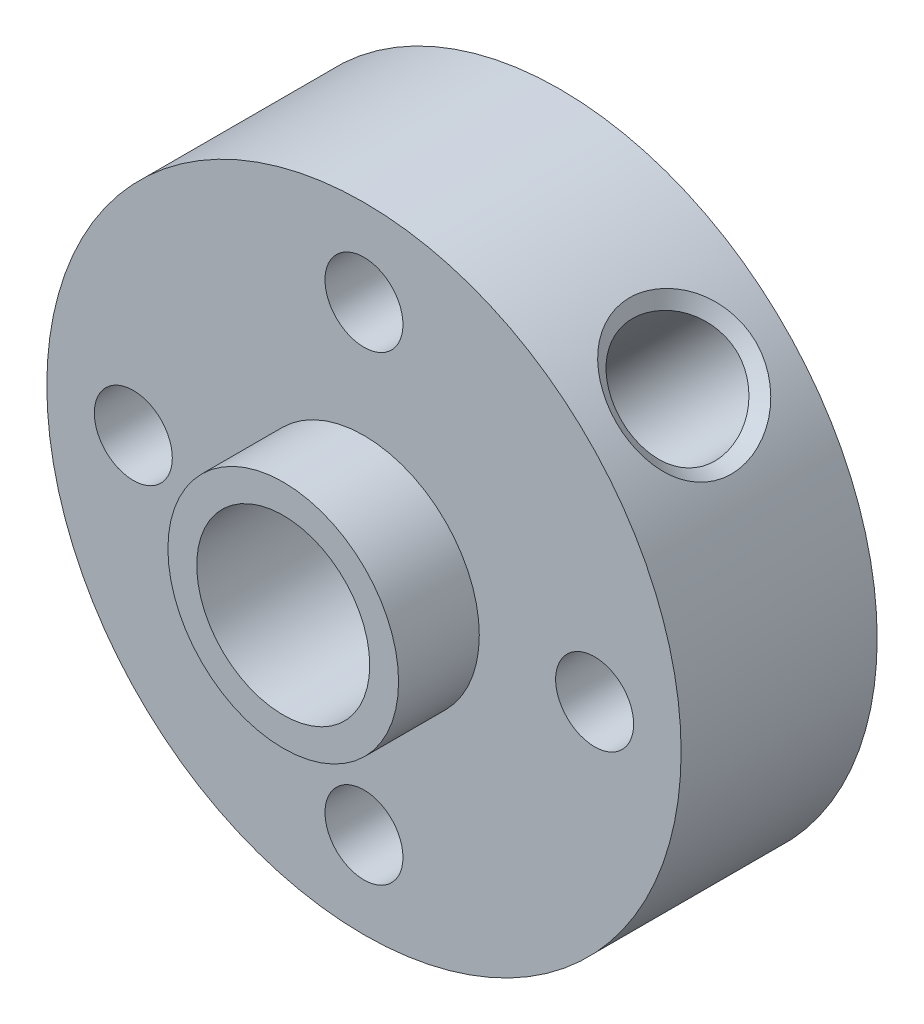
ISO-10303-21;
HEADER;
FILE_DESCRIPTION(('STEP AP214'),'2;1');
FILE_NAME('part.step','',(''),(''),'','','');
FILE_SCHEMA(('AUTOMOTIVE_DESIGN { 1 0 10303 214 1 1 1 1 }'));
ENDSEC;
DATA;
#1=APPLICATION_CONTEXT('core data for automotive mechanical design processes');
#2=APPLICATION_PROTOCOL_DEFINITION('international standard','automotive_design',2000,#1);
#3=PRODUCT_CONTEXT('',#1,'mechanical');
#4=PRODUCT('Part','Part','',(#3));
#5=PRODUCT_RELATED_PRODUCT_CATEGORY('part','',(#4));
#6=PRODUCT_DEFINITION_FORMATION('','',#4);
#7=PRODUCT_DEFINITION_CONTEXT('part definition',#1,'design');
#8=PRODUCT_DEFINITION('design','',#6,#7);
#9=PRODUCT_DEFINITION_SHAPE('','',#8);
#10=(LENGTH_UNIT() NAMED_UNIT(*) SI_UNIT(.MILLI.,.METRE.));
#11=(NAMED_UNIT(*) PLANE_ANGLE_UNIT() SI_UNIT($,.RADIAN.));
#12=(NAMED_UNIT(*) SI_UNIT($,.STERADIAN.) SOLID_ANGLE_UNIT());
#13=UNCERTAINTY_MEASURE_WITH_UNIT(LENGTH_MEASURE(1.E-05),#10,'distance_accuracy_value','');
#14=(GEOMETRIC_REPRESENTATION_CONTEXT(3) GLOBAL_UNCERTAINTY_ASSIGNED_CONTEXT((#13)) GLOBAL_UNIT_ASSIGNED_CONTEXT((#10,
#11,#12)) REPRESENTATION_CONTEXT('',''));
#15=CARTESIAN_POINT('',(0.,0.,0.));
#16=DIRECTION('',(0.,0.,1.));
#17=DIRECTION('',(1.,0.,0.));
#18=AXIS2_PLACEMENT_3D('',#15,#16,#17);
#19=CARTESIAN_POINT('',(0.,0.,3.4));
#20=DIRECTION('',(0.,0.,1.));
#21=DIRECTION('',(1.,0.,0.));
#22=AXIS2_PLACEMENT_3D('',#19,#20,#21);
#23=PLANE('',#22);
#24=CARTESIAN_POINT('',(0.,8.,3.4));
#25=DIRECTION('',(0.,0.,1.));
#26=DIRECTION('',(1.,0.,0.));
#27=AXIS2_PLACEMENT_3D('',#24,#25,#26);
#28=CIRCLE('',#27,1.35254999999999);
#29=CARTESIAN_POINT('',(1.35254999999999,8.,3.4));
#30=VERTEX_POINT('',#29);
#31=EDGE_CURVE('E182',#30,#30,#28,.T.);
#32=ORIENTED_EDGE('',*,*,#31,.F.);
#33=EDGE_LOOP('',(#32));
#34=FACE_BOUND('',#33,.T.);
#35=CARTESIAN_POINT('',(-8.,0.,3.4));
#36=DIRECTION('',(0.,0.,1.));
#37=DIRECTION('',(1.,0.,0.));
#38=AXIS2_PLACEMENT_3D('',#35,#36,#37);
#39=CIRCLE('',#38,1.35254999999999);
#40=CARTESIAN_POINT('',(-6.64745000000001,0.,3.4));
#41=VERTEX_POINT('',#40);
#42=EDGE_CURVE('E174',#41,#41,#39,.T.);
#43=ORIENTED_EDGE('',*,*,#42,.F.);
#44=EDGE_LOOP('',(#43));
#45=FACE_BOUND('',#44,.T.);
#46=CARTESIAN_POINT('',(8.,0.,3.4));
#47=DIRECTION('',(0.,0.,1.));
#48=DIRECTION('',(1.,0.,0.));
#49=AXIS2_PLACEMENT_3D('',#46,#47,#48);
#50=CIRCLE('',#49,1.35254999999999);
#51=CARTESIAN_POINT('',(9.35254999999999,0.,3.4));
#52=VERTEX_POINT('',#51);
#53=EDGE_CURVE('E169',#52,#52,#50,.T.);
#54=ORIENTED_EDGE('',*,*,#53,.F.);
#55=EDGE_LOOP('',(#54));
#56=FACE_BOUND('',#55,.T.);
#57=CARTESIAN_POINT('',(0.,-8.,3.4));
#58=DIRECTION('',(0.,0.,1.));
#59=DIRECTION('',(1.,0.,0.));
#60=AXIS2_PLACEMENT_3D('',#57,#58,#59);
#61=CIRCLE('',#60,1.35254999999999);
#62=CARTESIAN_POINT('',(1.35254999999999,-8.,3.4));
#63=VERTEX_POINT('',#62);
#64=EDGE_CURVE('E96',#63,#63,#61,.T.);
#65=ORIENTED_EDGE('',*,*,#64,.F.);
#66=EDGE_LOOP('',(#65));
#67=FACE_BOUND('',#66,.T.);
#68=CARTESIAN_POINT('',(0.,0.,3.4));
#69=DIRECTION('',(0.,0.,1.));
#70=DIRECTION('',(1.,0.,0.));
#71=AXIS2_PLACEMENT_3D('',#68,#69,#70);
#72=CIRCLE('',#71,11.);
#73=CARTESIAN_POINT('',(11.,0.,3.4));
#74=VERTEX_POINT('',#73);
#75=EDGE_CURVE('E57',#74,#74,#72,.T.);
#76=ORIENTED_EDGE('',*,*,#75,.T.);
#77=EDGE_LOOP('',(#76));
#78=FACE_BOUND('',#77,.T.);
#79=CARTESIAN_POINT('',(0.,0.,3.4));
#80=DIRECTION('',(0.,0.,1.));
#81=DIRECTION('',(1.,0.,0.));
#82=AXIS2_PLACEMENT_3D('',#79,#80,#81);
#83=CIRCLE('',#82,4.);
#84=CARTESIAN_POINT('',(4.,0.,3.4));
#85=VERTEX_POINT('',#84);
#86=EDGE_CURVE('E65',#85,#85,#83,.T.);
#87=ORIENTED_EDGE('',*,*,#86,.F.);
#88=EDGE_LOOP('',(#87));
#89=FACE_BOUND('',#88,.T.);
#90=ADVANCED_FACE('F35',(#34,#45,#56,#67,#78,#89),#23,.T.);
#91=CARTESIAN_POINT('',(0.,0.,-3.4));
#92=DIRECTION('',(0.,0.,1.));
#93=DIRECTION('',(1.,0.,0.));
#94=AXIS2_PLACEMENT_3D('',#91,#92,#93);
#95=CYLINDRICAL_SURFACE('',#94,11.);
#96=CARTESIAN_POINT('',(5.80850921114971,9.34137145948008,0.));
#97=CARTESIAN_POINT('',(5.80860175270186,9.34130684226353,0.637752239425181));
#98=CARTESIAN_POINT('',(6.04841944563921,9.19795689630477,1.26506432985481));
#99=CARTESIAN_POINT('',(6.80772994268232,8.6547578245762,2.1593530444314));
#100=CARTESIAN_POINT('',(7.31255506753503,8.24383991985221,2.42181611028022));
#101=CARTESIAN_POINT('',(8.24208780154512,7.31421539613681,2.42137394363942));
#102=CARTESIAN_POINT('',(8.65342910417239,6.80927509037896,2.16023058528547));
#103=CARTESIAN_POINT('',(9.19833006953286,6.04820111625001,1.26575073384544));
#104=CARTESIAN_POINT('',(9.34130756360716,5.80859981124356,0.640244269694806));
#105=CARTESIAN_POINT('',(9.34143535072448,5.80841861849953,-0.63996115444348));
#106=CARTESIAN_POINT('',(9.19862099961548,6.04773368941902,-1.26485137218771));
#107=CARTESIAN_POINT('',(8.65403117260026,6.8085025567722,-2.15966842361701));
#108=CARTESIAN_POINT('',(8.24214650834189,7.31418190369821,-2.42143639363606));
#109=CARTESIAN_POINT('',(7.31242801405934,8.24394174367863,-2.42175361413118));
#110=CARTESIAN_POINT('',(6.80825671047602,8.65433029295559,-2.15959971653594));
#111=CARTESIAN_POINT('',(6.04869975760828,9.19780320357039,-1.26576913530237));
#112=CARTESIAN_POINT('',(5.80841666959755,9.34143607669663,-0.637752239425181));
#113=CARTESIAN_POINT('',(5.80850921114971,9.34137145948008,0.));
#114=B_SPLINE_CURVE_WITH_KNOTS('',3,(#96,#97,#98,#99,#100,#101,#102,#103,#104,#105,#106,#107,
#108,#109,#110,#111,#112,#113),.UNSPECIFIED.,.T.,.F.,(4,2,2,2,2,2,2,2,4),(-3.18999496817969E-06,
0.00189587305523978,0.00379493610544773,0.00569399915565569,0.00759306220586365,
0.0094921252560716,0.0113911883062796,0.0132902513564875,0.0151893144066955),.UNSPECIFIED.);
#115=CARTESIAN_POINT('',(5.80850921114971,9.34137145948008,0.));
#116=VERTEX_POINT('',#115);
#117=EDGE_CURVE('E10',#116,#116,#114,.F.);
#118=ORIENTED_EDGE('',*,*,#117,.T.);
#119=EDGE_LOOP('',(#118));
#120=FACE_BOUND('',#119,.T.);
#121=CARTESIAN_POINT('',(0.,0.,-3.4));
#122=DIRECTION('',(0.,0.,1.));
#123=DIRECTION('',(1.,0.,0.));
#124=AXIS2_PLACEMENT_3D('',#121,#122,#123);
#125=CIRCLE('',#124,11.);
#126=CARTESIAN_POINT('',(11.,0.,-3.4));
#127=VERTEX_POINT('',#126);
#128=EDGE_CURVE('E52',#127,#127,#125,.T.);
#129=ORIENTED_EDGE('',*,*,#128,.T.);
#130=EDGE_LOOP('',(#129));
#131=FACE_BOUND('',#130,.T.);
#132=ORIENTED_EDGE('',*,*,#75,.F.);
#133=EDGE_LOOP('',(#132));
#134=FACE_BOUND('',#133,.T.);
#135=ADVANCED_FACE('F111',(#120,#131,#134),#95,.T.);
#136=CARTESIAN_POINT('',(0.,0.,-3.4));
#137=DIRECTION('',(0.,0.,1.));
#138=DIRECTION('',(1.,0.,0.));
#139=AXIS2_PLACEMENT_3D('',#136,#137,#138);
#140=PLANE('',#139);
#141=CARTESIAN_POINT('',(0.,8.,-3.4));
#142=DIRECTION('',(0.,0.,1.));
#143=DIRECTION('',(1.,0.,0.));
#144=AXIS2_PLACEMENT_3D('',#141,#142,#143);
#145=CIRCLE('',#144,1.35255);
#146=CARTESIAN_POINT('',(1.35255,8.,-3.4));
#147=VERTEX_POINT('',#146);
#148=EDGE_CURVE('E185',#147,#147,#145,.T.);
#149=ORIENTED_EDGE('',*,*,#148,.T.);
#150=EDGE_LOOP('',(#149));
#151=FACE_BOUND('',#150,.T.);
#152=CARTESIAN_POINT('',(-8.,0.,-3.4));
#153=DIRECTION('',(0.,0.,1.));
#154=DIRECTION('',(1.,0.,0.));
#155=AXIS2_PLACEMENT_3D('',#152,#153,#154);
#156=CIRCLE('',#155,1.35255);
#157=CARTESIAN_POINT('',(-6.64745,0.,-3.4));
#158=VERTEX_POINT('',#157);
#159=EDGE_CURVE('E179',#158,#158,#156,.T.);
#160=ORIENTED_EDGE('',*,*,#159,.T.);
#161=EDGE_LOOP('',(#160));
#162=FACE_BOUND('',#161,.T.);
#163=CARTESIAN_POINT('',(8.,0.,-3.4));
#164=DIRECTION('',(0.,0.,1.));
#165=DIRECTION('',(1.,0.,0.));
#166=AXIS2_PLACEMENT_3D('',#163,#164,#165);
#167=CIRCLE('',#166,1.35255);
#168=CARTESIAN_POINT('',(9.35255,0.,-3.4));
#169=VERTEX_POINT('',#168);
#170=EDGE_CURVE('E166',#169,#169,#167,.T.);
#171=ORIENTED_EDGE('',*,*,#170,.T.);
#172=EDGE_LOOP('',(#171));
#173=FACE_BOUND('',#172,.T.);
#174=CARTESIAN_POINT('',(0.,-8.,-3.4));
#175=DIRECTION('',(0.,0.,1.));
#176=DIRECTION('',(1.,0.,0.));
#177=AXIS2_PLACEMENT_3D('',#174,#175,#176);
#178=CIRCLE('',#177,1.35255);
#179=CARTESIAN_POINT('',(1.35255,-8.,-3.4));
#180=VERTEX_POINT('',#179);
#181=EDGE_CURVE('E171',#180,#180,#178,.T.);
#182=ORIENTED_EDGE('',*,*,#181,.T.);
#183=EDGE_LOOP('',(#182));
#184=FACE_BOUND('',#183,.T.);
#185=CARTESIAN_POINT('',(0.,0.,-3.4));
#186=DIRECTION('',(0.,0.,1.));
#187=DIRECTION('',(1.,0.,0.));
#188=AXIS2_PLACEMENT_3D('',#185,#186,#187);
#189=CIRCLE('',#188,3.);
#190=CARTESIAN_POINT('',(3.,0.,-3.4));
#191=VERTEX_POINT('',#190);
#192=EDGE_CURVE('E98',#191,#191,#189,.T.);
#193=ORIENTED_EDGE('',*,*,#192,.T.);
#194=EDGE_LOOP('',(#193));
#195=FACE_BOUND('',#194,.T.);
#196=ORIENTED_EDGE('',*,*,#128,.F.);
#197=EDGE_LOOP('',(#196));
#198=FACE_BOUND('',#197,.T.);
#199=ADVANCED_FACE('F117',(#151,#162,#173,#184,#195,#198),#140,.F.);
#200=CARTESIAN_POINT('',(0.,0.,6.2));
#201=DIRECTION('',(0.,0.,-1.));
#202=DIRECTION('',(-1.,0.,0.));
#203=AXIS2_PLACEMENT_3D('',#200,#201,#202);
#204=CYLINDRICAL_SURFACE('',#203,4.);
#205=CARTESIAN_POINT('',(0.,0.,6.2));
#206=DIRECTION('',(0.,0.,1.));
#207=DIRECTION('',(1.,0.,0.));
#208=AXIS2_PLACEMENT_3D('',#205,#206,#207);
#209=CIRCLE('',#208,4.);
#210=CARTESIAN_POINT('',(4.,0.,6.2));
#211=VERTEX_POINT('',#210);
#212=EDGE_CURVE('E62',#211,#211,#209,.T.);
#213=ORIENTED_EDGE('',*,*,#212,.F.);
#214=EDGE_LOOP('',(#213));
#215=FACE_BOUND('',#214,.T.);
#216=ORIENTED_EDGE('',*,*,#86,.T.);
#217=EDGE_LOOP('',(#216));
#218=FACE_BOUND('',#217,.T.);
#219=ADVANCED_FACE('F108',(#215,#218),#204,.T.);
#220=CARTESIAN_POINT('',(0.,0.,6.2));
#221=DIRECTION('',(0.,0.,1.));
#222=DIRECTION('',(1.,0.,0.));
#223=AXIS2_PLACEMENT_3D('',#220,#221,#222);
#224=PLANE('',#223);
#225=CARTESIAN_POINT('',(0.,0.,6.2));
#226=DIRECTION('',(0.,0.,1.));
#227=DIRECTION('',(1.,0.,0.));
#228=AXIS2_PLACEMENT_3D('',#225,#226,#227);
#229=CIRCLE('',#228,3.);
#230=CARTESIAN_POINT('',(3.,0.,6.2));
#231=VERTEX_POINT('',#230);
#232=EDGE_CURVE('E95',#231,#231,#229,.T.);
#233=ORIENTED_EDGE('',*,*,#232,.F.);
#234=EDGE_LOOP('',(#233));
#235=FACE_BOUND('',#234,.T.);
#236=ORIENTED_EDGE('',*,*,#212,.T.);
#237=EDGE_LOOP('',(#236));
#238=FACE_BOUND('',#237,.T.);
#239=ADVANCED_FACE('F200',(#235,#238),#224,.T.);
#240=CARTESIAN_POINT('',(0.,0.,-3.4));
#241=DIRECTION('',(0.,0.,1.));
#242=DIRECTION('',(1.,0.,0.));
#243=AXIS2_PLACEMENT_3D('',#240,#241,#242);
#244=CYLINDRICAL_SURFACE('',#243,3.);
#245=CARTESIAN_POINT('',(0.140964874131704,2.99668632063168,0.));
#246=CARTESIAN_POINT('',(0.14097359642594,2.99668877876177,0.0982671401591537));
#247=CARTESIAN_POINT('',(0.150783604937559,2.99627297936712,0.19656034071747));
#248=CARTESIAN_POINT('',(0.188643120098605,2.99411844316388,0.38960439575876));
#249=CARTESIAN_POINT('',(0.216725857438612,2.99237729510123,0.484348463165479));
#250=CARTESIAN_POINT('',(0.287566324055803,2.98639263110845,0.666884459705019));
#251=CARTESIAN_POINT('',(0.330177706650304,2.98217377806387,0.754735365241625));
#252=CARTESIAN_POINT('',(0.426893750215531,2.96987148458312,0.92348200505403));
#253=CARTESIAN_POINT('',(0.481000510439046,2.9617873379405,1.00437646516826));
#254=CARTESIAN_POINT('',(0.607371814508555,2.93868158824322,1.17102358549829));
#255=CARTESIAN_POINT('',(0.681155761442136,2.92276043053348,1.25549942358805));
#256=CARTESIAN_POINT('',(0.837366259695042,2.88190070504922,1.41373187372428));
#257=CARTESIAN_POINT('',(0.919802265197737,2.8569521986231,1.48747654534154));
#258=CARTESIAN_POINT('',(1.10320182024356,2.79173209928646,1.63306183144041));
#259=CARTESIAN_POINT('',(1.20509710343995,2.74973294137712,1.70298665445153));
#260=CARTESIAN_POINT('',(1.41194707062091,2.64944107376143,1.82407543706994));
#261=CARTESIAN_POINT('',(1.5168957838101,2.59117846972164,1.87527366118514));
#262=CARTESIAN_POINT('',(1.6983111335789,2.47472666269574,1.94555936794379));
#263=CARTESIAN_POINT('',(1.77528377164386,2.42022704728202,1.96948922093328));
#264=CARTESIAN_POINT('',(1.92547501725124,2.30252473801262,2.0039293511286));
#265=CARTESIAN_POINT('',(1.99869643227694,2.2393286872687,2.01444980926693));
#266=CARTESIAN_POINT('',(2.13910271892289,2.10562450185854,2.02149290497818));
#267=CARTESIAN_POINT('',(2.20627759644525,2.03510466171401,2.01799278762425));
#268=CARTESIAN_POINT('',(2.33255181669655,1.88905481044295,1.99715109462226));
#269=CARTESIAN_POINT('',(2.39164876160439,1.81352332151886,1.9798054195195));
#270=CARTESIAN_POINT('',(2.49971448548471,1.6613245603167,1.93261511708822));
#271=CARTESIAN_POINT('',(2.54883956691533,1.58469897586444,1.90298992616388));
#272=CARTESIAN_POINT('',(2.63800401251086,1.43136695290519,1.8325357609794));
#273=CARTESIAN_POINT('',(2.67804165557309,1.35466050184169,1.79170466762259));
#274=CARTESIAN_POINT('',(2.75345510104509,1.19463975046344,1.69496537461078));
#275=CARTESIAN_POINT('',(2.787796675907,1.11155525713123,1.63787646031065));
#276=CARTESIAN_POINT('',(2.84685752106799,0.950160561205845,1.51289259923297));
#277=CARTESIAN_POINT('',(2.87156539243243,0.871856106322446,1.44498498434907));
#278=CARTESIAN_POINT('',(2.91617925734933,0.709970040641031,1.28735653708993));
#279=CARTESIAN_POINT('',(2.93460347692185,0.627676256550695,1.1958861931617));
#280=CARTESIAN_POINT('',(2.96281033229786,0.477090854407047,1.00082926242335));
#281=CARTESIAN_POINT('',(2.97259833935266,0.40879055349958,0.897250252007682));
#282=CARTESIAN_POINT('',(2.98472399555785,0.305700690591403,0.705076019136408));
#283=CARTESIAN_POINT('',(2.98827953437657,0.266804690510238,0.618771187162267));
#284=CARTESIAN_POINT('',(2.9932640661576,0.203446427092796,0.44100125905567));
#285=CARTESIAN_POINT('',(2.99469691073788,0.178958069975086,0.349545822562628));
#286=CARTESIAN_POINT('',(2.99644764308712,0.146905797540695,0.162887188750377));
#287=CARTESIAN_POINT('',(2.99675683226214,0.139474085605033,0.067660497543301));
#288=CARTESIAN_POINT('',(2.9965921652876,0.142957841234314,-0.122460732300091));
#289=CARTESIAN_POINT('',(2.99611823788278,0.153874978350537,-0.217355239923924));
#290=CARTESIAN_POINT('',(2.99399098429709,0.190510510754694,-0.393616029634495));
#291=CARTESIAN_POINT('',(2.99246806736947,0.2145363992221,-0.475349718918805));
#292=CARTESIAN_POINT('',(2.98761013947686,0.273996768931342,-0.634495549889997));
#293=CARTESIAN_POINT('',(2.98427350540983,0.309441457308091,-0.711903752153196));
#294=CARTESIAN_POINT('',(2.97276792056858,0.407474824178514,-0.895005102536816));
#295=CARTESIAN_POINT('',(2.96310685021583,0.475117716846537,-0.997902056013119));
#296=CARTESIAN_POINT('',(2.93530525081688,0.624307012293909,-1.1918810771684));
#297=CARTESIAN_POINT('',(2.91714920976135,0.705878675557202,-1.28294114009789));
#298=CARTESIAN_POINT('',(2.86951418569794,0.879847726851795,-1.45317948195013));
#299=CARTESIAN_POINT('',(2.83989321425106,0.972370343170878,-1.53219071618379));
#300=CARTESIAN_POINT('',(2.76706735719638,1.16351196906969,-1.67500399877634));
#301=CARTESIAN_POINT('',(2.72388451741606,1.26212087737287,-1.73883043728458));
#302=CARTESIAN_POINT('',(2.63147402705235,1.44352768804252,-1.83891618100895));
#303=CARTESIAN_POINT('',(2.58472178406086,1.52598736934383,-1.87806706719257));
#304=CARTESIAN_POINT('',(2.48079979491718,1.68967604018049,-1.9428362764038));
#305=CARTESIAN_POINT('',(2.42363680374714,1.77090579094942,-1.9684633325463));
#306=CARTESIAN_POINT('',(2.29931281205703,1.92960053352642,-2.00489733174875));
#307=CARTESIAN_POINT('',(2.23210753109171,2.00704672689031,-2.01563635576009));
#308=CARTESIAN_POINT('',(2.08973540745282,2.1548847498933,-2.0213803799619));
#309=CARTESIAN_POINT('',(2.01456988198504,2.22527774290684,-2.01638797935981));
#310=CARTESIAN_POINT('',(1.86495146837063,2.35177058731535,-1.99198783716143));
#311=CARTESIAN_POINT('',(1.79088302793201,2.40855160452958,-1.97371078647439));
#312=CARTESIAN_POINT('',(1.64061098326316,2.51332292185118,-1.92496500434514));
#313=CARTESIAN_POINT('',(1.5644070389501,2.56131181251842,-1.89449432066586));
#314=CARTESIAN_POINT('',(1.40792958231886,2.65071645149137,-1.82063779440984));
#315=CARTESIAN_POINT('',(1.32766176522854,2.69162825481495,-1.77663600997339));
#316=CARTESIAN_POINT('',(1.16951120459241,2.76402268465499,-1.67792532616774));
#317=CARTESIAN_POINT('',(1.09162983972056,2.79549994963953,-1.62321036772058));
#318=CARTESIAN_POINT('',(0.928302223601384,2.85428183648066,-1.49489928218128));
#319=CARTESIAN_POINT('',(0.843606433218726,2.88014015450953,-1.41968569673839));
#320=CARTESIAN_POINT('',(0.683120162751911,2.92236843279855,-1.25783818901386));
#321=CARTESIAN_POINT('',(0.607336969846976,2.93873067122702,-1.17119504273096));
#322=CARTESIAN_POINT('',(0.472662666130019,2.96327075304597,-0.993172326488885));
#323=CARTESIAN_POINT('',(0.413007984872825,2.97189939899243,-0.90243536361787));
#324=CARTESIAN_POINT('',(0.308525072370775,2.98455844193639,-0.712517066078889));
#325=CARTESIAN_POINT('',(0.263670228258229,2.9885971248776,-0.613351296432071));
#326=CARTESIAN_POINT('',(0.20025085184245,2.99344447063229,-0.428720030428275));
#327=CARTESIAN_POINT('',(0.17822708167168,2.99473669600436,-0.34446678019364));
#328=CARTESIAN_POINT('',(0.148588007584813,2.99635601576172,-0.173480606452644));
#329=CARTESIAN_POINT('',(0.140957174070218,2.99668415058877,-0.0867504581809674));
#330=CARTESIAN_POINT('',(0.140964874131704,2.99668632063168,0.));
#331=B_SPLINE_CURVE_WITH_KNOTS('',3,(#245,#246,#247,#248,#249,#250,#251,#252,#253,#254,#255,
#256,#257,#258,#259,#260,#261,#262,#263,#264,#265,#266,#267,#268,#269,#270,#271,#272,#273,#274,
#275,#276,#277,#278,#279,#280,#281,#282,#283,#284,#285,#286,#287,#288,#289,#290,#291,#292,#293,
#294,#295,#296,#297,#298,#299,#300,#301,#302,#303,#304,#305,#306,#307,#308,#309,#310,#311,#312,
#313,#314,#315,#316,#317,#318,#319,#320,#321,#322,#323,#324,#325,#326,#327,#328,#329,#330),
.UNSPECIFIED.,.T.,.F.,(4,2,2,2,2,2,2,2,2,2,2,2,2,2,2,2,2,2,2,2,2,2,2,2,2,2,2,2,2,2,2,2,2,2,2,2,
2,2,2,2,2,2,4),(0.,0.29440353638005,0.589343975595895,0.881397200780215,1.17350380579788,
1.51211387476106,1.85109787614565,2.24051778682945,2.62922155934115,2.91986353918583,
3.2102847206695,3.50117743686839,3.79215631384675,4.07814540042059,4.3641886063847,
4.68247532658298,5.00113752008123,5.37279099606918,5.74421316067909,6.02735164683165,
6.30997574768518,6.59478313131644,6.87961643081159,7.13424228210729,7.38909637504131,
7.75770005887128,8.12697946404343,8.50098664778864,8.87438897473932,9.18078287749253,
9.48697868121592,9.79456680098561,10.1021041025096,10.3861411287428,10.6702236483578,
10.9698648671405,11.269676046877,11.6168834583151,11.9643728107565,12.2899631035632,
12.6149646923712,12.8751457033016,13.1350458248448),.UNSPECIFIED.);
#332=CARTESIAN_POINT('',(0.140964874131704,2.99668632063168,0.));
#333=VERTEX_POINT('',#332);
#334=EDGE_CURVE('E89',#333,#333,#331,.T.);
#335=ORIENTED_EDGE('',*,*,#334,.T.);
#336=EDGE_LOOP('',(#335));
#337=FACE_BOUND('',#336,.T.);
#338=ORIENTED_EDGE('',*,*,#192,.F.);
#339=EDGE_LOOP('',(#338));
#340=FACE_BOUND('',#339,.T.);
#341=ORIENTED_EDGE('',*,*,#232,.T.);
#342=EDGE_LOOP('',(#341));
#343=FACE_BOUND('',#342,.T.);
#344=ADVANCED_FACE('F83',(#337,#340,#343),#244,.F.);
#345=CARTESIAN_POINT('',(7.77817459305204,7.77817459305201,0.));
#346=DIRECTION('',(0.707106781186549,0.707106781186546,0.));
#347=DIRECTION('',(-0.707106781186546,0.707106781186549,0.));
#348=AXIS2_PLACEMENT_3D('',#345,#346,#347);
#349=CYLINDRICAL_SURFACE('',#348,2.01929999999999);
#350=CARTESIAN_POINT('',(5.91506401697902,8.77078546347897,0.));
#351=CARTESIAN_POINT('',(5.91505848231522,8.77078895441069,-0.0332110676748999));
#352=CARTESIAN_POINT('',(5.91584250371787,8.77036908136088,-0.0664205027333981));
#353=CARTESIAN_POINT('',(5.91894801804012,8.7686844720424,-0.132706000824386));
#354=CARTESIAN_POINT('',(5.9212676546673,8.76742075581777,-0.165782176435799));
#355=CARTESIAN_POINT('',(5.92740096477233,8.76405141279832,-0.231730396913026));
#356=CARTESIAN_POINT('',(5.93121367555311,8.7619463284787,-0.264602559475331));
#357=CARTESIAN_POINT('',(5.94028892447994,8.75689761117119,-0.33007339450581));
#358=CARTESIAN_POINT('',(5.94555114052323,8.7539541644756,-0.362672126078199));
#359=CARTESIAN_POINT('',(5.95748172497235,8.74723181556498,-0.427526437618046));
#360=CARTESIAN_POINT('',(5.96415019887331,8.74345285066972,-0.45978199165009));
#361=CARTESIAN_POINT('',(5.97884975539384,8.73506249034032,-0.523880394046921));
#362=CARTESIAN_POINT('',(5.9868811988934,8.73045087442044,-0.55572313069829));
#363=CARTESIAN_POINT('',(6.00426333819006,8.72039813550142,-0.618926309415734));
#364=CARTESIAN_POINT('',(6.01361451659092,8.71495670899628,-0.650286570375661));
#365=CARTESIAN_POINT('',(6.03359289306655,8.70324720139475,-0.712455190591757));
#366=CARTESIAN_POINT('',(6.04422059736454,8.69697879224988,-0.743263325292279));
#367=CARTESIAN_POINT('',(6.0667088867097,8.68361811087547,-0.804258051751251));
#368=CARTESIAN_POINT('',(6.07856993563722,8.67652552854269,-0.834444404496169));
#369=CARTESIAN_POINT('',(6.10348184418441,8.66151925847353,-0.894125891486483));
#370=CARTESIAN_POINT('',(6.11653308800739,8.65360530547822,-0.923620798638439));
#371=CARTESIAN_POINT('',(6.1437823270195,8.63695899466251,-0.981849692064878));
#372=CARTESIAN_POINT('',(6.15798061459985,8.62822642807899,-1.01058348182968));
#373=CARTESIAN_POINT('',(6.18748098358666,8.60994569245589,-1.0672204054046));
#374=CARTESIAN_POINT('',(6.20278327541986,8.60039736786602,-1.09512337941919));
#375=CARTESIAN_POINT('',(6.23444834486616,8.58048749877547,-1.15002897367341));
#376=CARTESIAN_POINT('',(6.25081127954805,8.57012583378044,-1.1770314596605));
#377=CARTESIAN_POINT('',(6.28455556770698,8.54859326407029,-1.23006622575013));
#378=CARTESIAN_POINT('',(6.30193706947595,8.53742224146554,-1.25609836367373));
#379=CARTESIAN_POINT('',(6.33767164204863,8.51426907303072,-1.30712323462615));
#380=CARTESIAN_POINT('',(6.35602490834891,8.50228676385234,-1.33211575668861));
#381=CARTESIAN_POINT('',(6.39367379710447,8.47753119815555,-1.38098995191832));
#382=CARTESIAN_POINT('',(6.41296973283743,8.46475767831074,-1.40487125057306));
#383=CARTESIAN_POINT('',(6.45239380966424,8.43836765389059,-1.45144277207452));
#384=CARTESIAN_POINT('',(6.47252179241437,8.42475130946692,-1.47413321969915));
#385=CARTESIAN_POINT('',(6.51347588006849,8.39664993352501,-1.51827896365428));
#386=CARTESIAN_POINT('',(6.53430150189428,8.38216549784592,-1.53973508781516));
#387=CARTESIAN_POINT('',(6.57659692078657,8.35237560191873,-1.58137915482344));
#388=CARTESIAN_POINT('',(6.59806639414691,8.33707055129587,-1.60156771966927));
#389=CARTESIAN_POINT('',(6.64157796071985,8.30566497179513,-1.6406458230446));
#390=CARTESIAN_POINT('',(6.66361982921346,8.28956475292207,-1.65953586105512));
#391=CARTESIAN_POINT('',(6.70820943365554,8.25660020779171,-1.69598536565465));
#392=CARTESIAN_POINT('',(6.73075699607695,8.23973614168033,-1.71354527988382));
#393=CARTESIAN_POINT('',(6.77629000761415,8.20527364445819,-1.74730308237523));
#394=CARTESIAN_POINT('',(6.79927530942779,8.18767545809095,-1.76350141922007));
#395=CARTESIAN_POINT('',(6.84561618019305,8.15177485327989,-1.79450451369917));
#396=CARTESIAN_POINT('',(6.86897161775489,8.13347268158226,-1.80930975345407));
#397=CARTESIAN_POINT('',(6.915985056941,8.09619410943874,-1.8374950782937));
#398=CARTESIAN_POINT('',(6.93964294335845,8.07721796109372,-1.8508756889275));
#399=CARTESIAN_POINT('',(6.98719359976604,8.03862146663374,-1.87618016635322));
#400=CARTESIAN_POINT('',(7.01108627669854,8.01900136905856,-1.88810458698167));
#401=CARTESIAN_POINT('',(7.05903882080187,7.97914700798319,-1.91046511062842));
#402=CARTESIAN_POINT('',(7.08309862402777,7.95891297037338,-1.92090175318898));
#403=CARTESIAN_POINT('',(7.13131772267692,7.91786078233943,-1.94025519102211));
#404=CARTESIAN_POINT('',(7.15547698625861,7.89704280807244,-1.94917243903047));
#405=CARTESIAN_POINT('',(7.20382730656836,7.85485282469413,-1.96545562647138));
#406=CARTESIAN_POINT('',(7.2280183572575,7.83348090947038,-1.97282182688519));
#407=CARTESIAN_POINT('',(7.27636455934795,7.7902131575659,-1.9859715835014));
#408=CARTESIAN_POINT('',(7.30051970910261,7.76831729759627,-1.99175506921085));
#409=CARTESIAN_POINT('',(7.34872645183661,7.72403178920513,-2.0017081311534));
#410=CARTESIAN_POINT('',(7.37277800466266,7.70164196687641,-2.00587712907822));
#411=CARTESIAN_POINT('',(7.42070990754527,7.65639875033492,-2.01257039611203));
#412=CARTESIAN_POINT('',(7.4445901076154,7.63354500443548,-2.01509336544913));
#413=CARTESIAN_POINT('',(7.49211187188735,7.58740398851408,-2.01846297530972));
#414=CARTESIAN_POINT('',(7.51575306944566,7.56411617370422,-2.01930734284276));
#415=CARTESIAN_POINT('',(7.56268537381162,7.51718143523515,-2.01929214610317));
#416=CARTESIAN_POINT('',(7.58597640723568,7.49353443833364,-2.01843222954557));
#417=CARTESIAN_POINT('',(7.63213269087667,7.44599278654124,-2.01503739250119));
#418=CARTESIAN_POINT('',(7.65499833438957,7.4220983958268,-2.01250410727608));
#419=CARTESIAN_POINT('',(7.70027314745174,7.37413068840907,-2.00579376995032));
#420=CARTESIAN_POINT('',(7.7226825250674,7.35005746041973,-2.00161748558656));
#421=CARTESIAN_POINT('',(7.76701398076268,7.30180085174933,-1.99165308065752));
#422=CARTESIAN_POINT('',(7.78893610238858,7.27761748114641,-1.98586510476038));
#423=CARTESIAN_POINT('',(7.83226222533887,7.22920923113276,-1.97270874422235));
#424=CARTESIAN_POINT('',(7.85366613690357,7.2049843452983,-1.96534008793903));
#425=CARTESIAN_POINT('',(7.89592497299628,7.1565616692253,-1.94905366064103));
#426=CARTESIAN_POINT('',(7.91677971060388,7.13236389082918,-1.94013536983414));
#427=CARTESIAN_POINT('',(7.95790929380115,7.08406400516904,-1.92078078423956));
#428=CARTESIAN_POINT('',(7.97818389178885,7.05996194242694,-1.91034385253155));
#429=CARTESIAN_POINT('',(8.01812224950333,7.01192205696619,-1.88798297317344));
#430=CARTESIAN_POINT('',(8.03778573410585,6.98798431189646,-1.87605836754498));
#431=CARTESIAN_POINT('',(8.07647088550343,6.94034163726294,-1.85075303378894));
#432=CARTESIAN_POINT('',(8.09549227656628,6.9166368107419,-1.83737169026327));
#433=CARTESIAN_POINT('',(8.13286222382865,6.86952855499725,-1.80918371284058));
#434=CARTESIAN_POINT('',(8.15121052192307,6.84612524357941,-1.79437653992198));
#435=CARTESIAN_POINT('',(8.18720327904013,6.79968863480246,-1.76336770394078));
#436=CARTESIAN_POINT('',(8.20484750501893,6.77665546143919,-1.74716558467095));
#437=CARTESIAN_POINT('',(8.23940098478744,6.73102767566809,-1.71339764848219));
#438=CARTESIAN_POINT('',(8.25631002512714,6.70843319166702,-1.69583143959049));
#439=CARTESIAN_POINT('',(8.28936245658593,6.6637516328335,-1.65936614329798));
#440=CARTESIAN_POINT('',(8.30550563361525,6.6416647007617,-1.64046668682979));
#441=CARTESIAN_POINT('',(8.33699399859716,6.59806596681262,-1.6013657262551));
#442=CARTESIAN_POINT('',(8.35233893380897,6.57655434812705,-1.5811638142422));
#443=CARTESIAN_POINT('',(8.38220479917344,6.53417810328664,-1.53948894405403));
#444=CARTESIAN_POINT('',(8.39672538327564,6.51331375048718,-1.51801545970707));
#445=CARTESIAN_POINT('',(8.42489311596826,6.4722882785207,-1.47382811571226));
#446=CARTESIAN_POINT('',(8.43853973376537,6.45212759003505,-1.45111351751843));
#447=CARTESIAN_POINT('',(8.46498311220623,6.41264578919864,-1.40450223516731));
#448=CARTESIAN_POINT('',(8.47778006619722,6.39332448618789,-1.38060582211521));
#449=CARTESIAN_POINT('',(8.50257514167932,6.35563320480252,-1.33172197410269));
#450=CARTESIAN_POINT('',(8.51457408105177,6.33726225684295,-1.30673570103524));
#451=CARTESIAN_POINT('',(8.5377528699454,6.3015013268,-1.25573829303499));
#452=CARTESIAN_POINT('',(8.54893337535542,6.28411056183228,-1.22972800503158));
#453=CARTESIAN_POINT('',(8.57047851389438,6.25035520776226,-1.17674891016928));
#454=CARTESIAN_POINT('',(8.58084366898023,6.23398996354728,-1.14978073283482));
#455=CARTESIAN_POINT('',(8.60075497666371,6.20232675855256,-1.09495202742266));
#456=CARTESIAN_POINT('',(8.61030156068651,6.18702823636469,-1.06709198016873));
#457=CARTESIAN_POINT('',(8.62857424193247,6.15754073429502,-1.01054566085374));
#458=CARTESIAN_POINT('',(8.6373007052626,6.14335125980823,-0.98185976499947));
#459=CARTESIAN_POINT('',(8.65393118322941,6.1161238432409,-0.923727827713149));
#460=CARTESIAN_POINT('',(8.66183551201453,6.10308546160267,-0.894282082037694));
#461=CARTESIAN_POINT('',(8.67681986647411,6.07820231388729,-0.834696503956042));
#462=CARTESIAN_POINT('',(8.68390015394206,6.06635716888693,-0.804556895651193));
#463=CARTESIAN_POINT('',(8.69723453927415,6.04390255145558,-0.743649643103456));
#464=CARTESIAN_POINT('',(8.70348883246057,6.03329278696552,-0.712882149330113));
#465=CARTESIAN_POINT('',(8.71516936551008,6.01335096704361,-0.65078517879946));
#466=CARTESIAN_POINT('',(8.72059570606081,6.00401875626215,-0.619455770895438));
#467=CARTESIAN_POINT('',(8.73061849592326,5.98667402839745,-0.556301032430913));
#468=CARTESIAN_POINT('',(8.73521490889622,5.97866156910146,-0.524475680221509));
#469=CARTESIAN_POINT('',(8.74357604893016,5.96399825071929,-0.460395119679624));
#470=CARTESIAN_POINT('',(8.74734054591037,5.95734776834859,-0.428139795039592));
#471=CARTESIAN_POINT('',(8.75403611517923,5.94545020513707,-0.363265361084169));
#472=CARTESIAN_POINT('',(8.75696669272247,5.94020395750586,-0.33064604769755));
#473=CARTESIAN_POINT('',(8.76199275794242,5.93115651464901,-0.265109684300497));
#474=CARTESIAN_POINT('',(8.76408740155927,5.92735678017527,-0.232192367504754));
#475=CARTESIAN_POINT('',(8.76744000846942,5.92124387879349,-0.16612606386624));
#476=CARTESIAN_POINT('',(8.76869668102399,5.91893300538346,-0.132976798738433));
#477=CARTESIAN_POINT('',(8.77037188909036,5.91583898922573,-0.0665124282631985));
#478=CARTESIAN_POINT('',(8.77078857901005,5.9150592106646,-0.0331971186146531));
#479=CARTESIAN_POINT('',(8.77078234422554,5.91506882985746,0.0334354198008879));
#480=CARTESIAN_POINT('',(8.77035936358661,5.91585833214921,0.0667526485478812));
#481=CARTESIAN_POINT('',(8.76867146473501,5.91897238819307,0.133224296589018));
#482=CARTESIAN_POINT('',(8.76740828879689,5.92129376528809,0.166378910068228));
#483=CARTESIAN_POINT('',(8.76404262761878,5.92742794695481,0.23245879572558));
#484=CARTESIAN_POINT('',(8.7619413437847,5.93123861650762,0.265384327842085));
#485=CARTESIAN_POINT('',(8.75690192757777,5.94030819641756,0.330939444120566));
#486=CARTESIAN_POINT('',(8.75396456516732,5.94556577413946,0.363569272205728));
#487=CARTESIAN_POINT('',(8.7472553538668,5.95748617552346,0.428466492217267));
#488=CARTESIAN_POINT('',(8.74348394143914,5.96414826411336,0.460734064467773));
#489=CARTESIAN_POINT('',(8.73510889001523,5.97883490576692,0.52484030722021));
#490=CARTESIAN_POINT('',(8.73050543884059,5.98685915131707,0.556679072780165));
#491=CARTESIAN_POINT('',(8.72046848535581,6.0042274881664,0.619861251959669));
#492=CARTESIAN_POINT('',(8.71503499303039,6.01357156358902,0.651204671532819));
#493=CARTESIAN_POINT('',(8.70334006221748,6.03353707477465,0.713329703342658));
#494=CARTESIAN_POINT('',(8.69707851221821,6.04415868256126,0.744111239275849));
#495=CARTESIAN_POINT('',(8.68372951263668,6.06663687147066,0.805046035453224));
#496=CARTESIAN_POINT('',(8.67664187185277,6.0784937384309,0.835199148335342));
#497=CARTESIAN_POINT('',(8.66164270405434,6.10340013586136,0.894810613656909));
#498=CARTESIAN_POINT('',(8.65373093354436,6.11645001867716,0.924268757591387));
#499=CARTESIAN_POINT('',(8.63708546101234,6.14370016084589,0.982423787635075));
#500=CARTESIAN_POINT('',(8.62835147637857,6.15790081550739,1.01112040761646));
#501=CARTESIAN_POINT('',(8.61006363456531,6.18741031938701,1.06768588347149));
#502=CARTESIAN_POINT('',(8.60050945492705,6.20271960408833,1.09555440793038));
#503=CARTESIAN_POINT('',(8.58058284492023,6.23440387837895,1.15039720437352));
#504=CARTESIAN_POINT('',(8.57021003759893,6.25077935830365,1.17737105617333));
#505=CARTESIAN_POINT('',(8.54864944445045,6.28455467519279,1.23035799961978));
#506=CARTESIAN_POINT('',(8.53746120026439,6.30195508720328,1.25637053833628));
#507=CARTESIAN_POINT('',(8.5142669232988,6.3377345712086,1.30736855221933));
#508=CARTESIAN_POINT('',(8.50226030619904,6.35611434037939,1.33235327267237));
#509=CARTESIAN_POINT('',(8.47744934140314,6.39382294388809,1.38122882200797));
#510=CARTESIAN_POINT('',(8.46464425050445,6.4131526587608,1.40511859474889));
#511=CARTESIAN_POINT('',(8.43818660196547,6.4526481078882,1.45171251711371));
#512=CARTESIAN_POINT('',(8.42453397317264,6.472813912287,1.47441656689831));
#513=CARTESIAN_POINT('',(8.39635830986087,6.51384425532208,1.51858066920913));
#514=CARTESIAN_POINT('',(8.38183596066717,6.53470823823055,1.5400416756681));
#515=CARTESIAN_POINT('',(8.351969724349,6.57707948460711,1.58168918955006));
#516=CARTESIAN_POINT('',(8.33662631249606,6.59858637281448,1.60187641986011));
#517=CARTESIAN_POINT('',(8.30514387938477,6.6421718620316,1.64094629790071));
#518=CARTESIAN_POINT('',(8.28900521800497,6.6642502023302,1.65982952661447));
#519=CARTESIAN_POINT('',(8.25596425137547,6.7089114379051,1.69626108459567));
#520=CARTESIAN_POINT('',(8.23906224475767,6.73149413415179,1.71380992880571));
#521=CARTESIAN_POINT('',(8.20452486185037,6.77709580693245,1.74754235960536));
#522=CARTESIAN_POINT('',(8.1868897618932,6.80011461732841,1.76372645378098));
#523=CARTESIAN_POINT('',(8.15091686836598,6.84652057975221,1.79469895545694));
#524=CARTESIAN_POINT('',(8.13257935010047,6.86990758539569,1.80948790205611));
#525=CARTESIAN_POINT('',(8.09523215855355,6.91698192631167,1.83763964193117));
#526=CARTESIAN_POINT('',(8.07622276636989,6.94066913338687,1.85100302244686));
#527=CARTESIAN_POINT('',(8.03756239098396,6.98827588717756,1.87627314501539));
#528=CARTESIAN_POINT('',(8.01791168882148,7.01219532897691,1.88818051455554));
#529=CARTESIAN_POINT('',(7.97799925524323,7.06019855062092,1.91050813867076));
#530=CARTESIAN_POINT('',(7.95773778839228,7.08428225591072,1.92092902624326));
#531=CARTESIAN_POINT('',(7.91663440543888,7.13254599725071,1.94025324141825));
#532=CARTESIAN_POINT('',(7.89579271257581,7.15672599326698,1.94915714353736));
#533=CARTESIAN_POINT('',(7.85355948229105,7.20511430797543,1.96541702019326));
#534=CARTESIAN_POINT('',(7.83216809594916,7.22932261717638,1.97277341505298));
#535=CARTESIAN_POINT('',(7.78886610971863,7.27769954816383,1.98590795958635));
#536=CARTESIAN_POINT('',(7.76695555486785,7.30186817319983,1.99168624562014));
#537=CARTESIAN_POINT('',(7.72264590918634,7.3500977793191,2.00163456225323));
#538=CARTESIAN_POINT('',(7.70024672405603,7.37415873852492,2.00580427946512));
#539=CARTESIAN_POINT('',(7.65499047475318,7.42210497878788,2.01250496091492));
#540=CARTESIAN_POINT('',(7.6321331487397,7.44599014806072,2.01503495878187));
#541=CARTESIAN_POINT('',(7.58599149586351,7.49351729355971,2.01842835834536));
#542=CARTESIAN_POINT('',(7.5627067222944,7.51715896970547,2.01928990301141));
#543=CARTESIAN_POINT('',(7.51578332169806,7.56408705345293,2.01930962548455));
#544=CARTESIAN_POINT('',(7.49214471288097,7.58737347921392,2.01846789065385));
#545=CARTESIAN_POINT('',(7.44462381284622,7.63351476265405,2.01510067480987));
#546=CARTESIAN_POINT('',(7.42074184574883,7.6563701017552,2.01257720237531));
#547=CARTESIAN_POINT('',(7.37280291219216,7.70161931472155,2.00588137793343));
#548=CARTESIAN_POINT('',(7.34874606889904,7.72401347747058,2.00171009336103));
#549=CARTESIAN_POINT('',(7.30052578359064,7.76830992133871,1.99175074429619));
#550=CARTESIAN_POINT('',(7.27636236810444,7.79021231742479,1.98596306203394));
#551=CARTESIAN_POINT('',(7.22799728700027,7.83349492235517,1.97280342889561));
#552=CARTESIAN_POINT('',(7.20379561933123,7.85487510211202,1.9654313899939));
#553=CARTESIAN_POINT('',(7.15542231471128,7.89708289606742,1.94913516554283));
#554=CARTESIAN_POINT('',(7.13125068661976,7.91791037294386,1.94021059834436));
#555=CARTESIAN_POINT('',(7.08300571479044,7.95898235211534,1.92084131379504));
#556=CARTESIAN_POINT('',(7.05893240880988,7.97922664576155,1.91039606027585));
#557=CARTESIAN_POINT('',(7.0109523232803,8.01910180559518,1.8880172512124));
#558=CARTESIAN_POINT('',(6.98704561336613,8.03873242597797,1.87608310861397));
#559=CARTESIAN_POINT('',(6.93946696699172,8.07734975240179,1.8507582721155));
#560=CARTESIAN_POINT('',(6.91579512590907,8.09633620386289,1.83736701094931));
#561=CARTESIAN_POINT('',(6.8687544685808,8.13363466655914,1.80915961919991));
#562=CARTESIAN_POINT('',(6.84538576357309,8.15194643451098,1.7943429814633));
#563=CARTESIAN_POINT('',(6.79901966627931,8.1878650143029,1.76331647829971));
#564=CARTESIAN_POINT('',(6.77602239247155,8.20547160375713,1.74710617835879));
#565=CARTESIAN_POINT('',(6.73046736854325,8.23994918296968,1.71332398716207));
#566=CARTESIAN_POINT('',(6.70790974153644,8.25681996827336,1.69575172118233));
#567=CARTESIAN_POINT('',(6.66330255203771,8.28979573602847,1.65927722399221));
#568=CARTESIAN_POINT('',(6.64125312562119,8.3059005145746,1.64037464194535));
#569=CARTESIAN_POINT('',(6.59772965029765,8.33731244865267,1.60127126221301));
#570=CARTESIAN_POINT('',(6.57625577402796,8.3526193661371,1.58107008105079));
#571=CARTESIAN_POINT('',(6.53395523867463,8.38240989608554,1.53940098090521));
#572=CARTESIAN_POINT('',(6.51312883517612,8.39689318525287,1.51793257114709));
#573=CARTESIAN_POINT('',(6.47217803913619,8.42498803995151,1.47376178901991));
#574=CARTESIAN_POINT('',(6.45205404773519,8.43859911096003,1.45105872989051));
#575=CARTESIAN_POINT('',(6.412641607477,8.46497605881706,1.40446505449887));
#576=CARTESIAN_POINT('',(6.39335320313625,8.47774189065399,1.38057437511064));
#577=CARTESIAN_POINT('',(6.35572093883282,8.50248187164733,1.33168729517015));
#578=CARTESIAN_POINT('',(6.33737663534314,8.51445639331655,1.30669142427597));
#579=CARTESIAN_POINT('',(6.30166169734439,8.53759335612589,1.25566428331663));
#580=CARTESIAN_POINT('',(6.28429074951755,8.54875605893468,1.22963335109846));
#581=CARTESIAN_POINT('',(6.25056870684025,8.57027174436702,1.17660500376648));
#582=CARTESIAN_POINT('',(6.23421735963792,8.58062492750963,1.14960783042252));
#583=CARTESIAN_POINT('',(6.20257622039538,8.60051776117262,1.09471617141338));
#584=CARTESIAN_POINT('',(6.1872861844547,8.61005759872417,1.06682189408277));
#585=CARTESIAN_POINT('',(6.15781064536435,8.62832151976732,1.01020504839583));
#586=CARTESIAN_POINT('',(6.14362486468714,8.63704580833864,0.981482690660231));
#587=CARTESIAN_POINT('',(6.11640053174703,8.65367593934065,0.923278698234417));
#588=CARTESIAN_POINT('',(6.10336164199338,8.66158202266287,0.893797290230083));
#589=CARTESIAN_POINT('',(6.07847390199302,8.67657315080218,0.834144193561218));
#590=CARTESIAN_POINT('',(6.06662464633153,8.68365847545264,0.803972744388656));
#591=CARTESIAN_POINT('',(6.04415897116503,8.69700545914624,0.743008567902712));
#592=CARTESIAN_POINT('',(6.03354209196648,8.70326742542992,0.712216077309766));
#593=CARTESIAN_POINT('',(6.01358395877872,8.71496508544354,0.650078836254119));
#594=CARTESIAN_POINT('',(6.00424222922454,8.72040108730159,0.618734296628391));
#595=CARTESIAN_POINT('',(5.98687714517838,8.73044423505152,0.555561996395583));
#596=CARTESIAN_POINT('',(5.97885336575347,8.73505164814228,0.523734395166795));
#597=CARTESIAN_POINT('',(5.96416685879513,8.74343508029986,0.459665040752808));
#598=CARTESIAN_POINT('',(5.95750385493659,8.74721126817109,0.427423373065973));
#599=CARTESIAN_POINT('',(5.94558149634992,8.75392975875101,0.362594950113253));
#600=CARTESIAN_POINT('',(5.9403221465917,8.75687205850716,0.33000819362594));
#601=CARTESIAN_POINT('',(5.93124948030675,8.76192039478079,0.264558756719001));
#602=CARTESIAN_POINT('',(5.92743662021943,8.7640261673422,0.231695992543265));
#603=CARTESIAN_POINT('',(5.92129943244238,8.76739901349091,0.165763357667138));
#604=CARTESIAN_POINT('',(5.91897622237649,8.76866545738792,0.132693350219354));
#605=CARTESIAN_POINT('',(5.91585954005474,8.77035786504081,0.0664162700650921));
#606=CARTESIAN_POINT('',(5.91506809466721,8.7707827151968,0.0332090739382825));
#607=CARTESIAN_POINT('',(5.91506401697902,8.77078546347897,0.));
#608=B_SPLINE_CURVE_WITH_KNOTS('',3,(#350,#351,#352,#353,#354,#355,#356,#357,#358,#359,#360,
#361,#362,#363,#364,#365,#366,#367,#368,#369,#370,#371,#372,#373,#374,#375,#376,#377,#378,#379,
#380,#381,#382,#383,#384,#385,#386,#387,#388,#389,#390,#391,#392,#393,#394,#395,#396,#397,#398,
#399,#400,#401,#402,#403,#404,#405,#406,#407,#408,#409,#410,#411,#412,#413,#414,#415,#416,#417,
#418,#419,#420,#421,#422,#423,#424,#425,#426,#427,#428,#429,#430,#431,#432,#433,#434,#435,#436,
#437,#438,#439,#440,#441,#442,#443,#444,#445,#446,#447,#448,#449,#450,#451,#452,#453,#454,#455,
#456,#457,#458,#459,#460,#461,#462,#463,#464,#465,#466,#467,#468,#469,#470,#471,#472,#473,#474,
#475,#476,#477,#478,#479,#480,#481,#482,#483,#484,#485,#486,#487,#488,#489,#490,#491,#492,#493,
#494,#495,#496,#497,#498,#499,#500,#501,#502,#503,#504,#505,#506,#507,#508,#509,#510,#511,#512,
#513,#514,#515,#516,#517,#518,#519,#520,#521,#522,#523,#524,#525,#526,#527,#528,#529,#530,#531,
#532,#533,#534,#535,#536,#537,#538,#539,#540,#541,#542,#543,#544,#545,#546,#547,#548,#549,#550,
#551,#552,#553,#554,#555,#556,#557,#558,#559,#560,#561,#562,#563,#564,#565,#566,#567,#568,#569,
#570,#571,#572,#573,#574,#575,#576,#577,#578,#579,#580,#581,#582,#583,#584,#585,#586,#587,#588,
#589,#590,#591,#592,#593,#594,#595,#596,#597,#598,#599,#600,#601,#602,#603,#604,#605,#606,#607),
.UNSPECIFIED.,.F.,.F.,(4,2,2,2,2,2,2,2,2,2,2,2,2,2,2,2,2,2,2,2,2,2,2,2,2,2,2,2,2,2,2,2,2,2,2,2,
2,2,2,2,2,2,2,2,2,2,2,2,2,2,2,2,2,2,2,2,2,2,2,2,2,2,2,2,2,2,2,2,2,2,2,2,2,2,2,2,2,2,2,2,2,2,2,2,
2,2,2,2,2,2,2,2,2,2,2,2,2,2,2,2,2,2,2,2,2,2,2,2,2,2,2,2,2,2,2,2,2,2,2,2,2,2,2,2,2,2,2,2,4),(0.,
0.0996185232297084,0.199116844300579,0.298551116680188,0.397963311008338,0.49738296572871,
0.596828985456463,0.69631146552342,0.795833527748782,0.8953931581202,0.994985041582449,
1.09460239245606,1.1942387811354,1.29388995865603,1.393555680488,1.49324152951262,
1.59296073557724,1.69266105104256,1.79229370113171,1.89187707253405,1.99142192213058,
2.09093312065152,2.19041140484922,2.28985513416549,2.38926205040907,2.48863104042629,
2.58796390213058,2.68726711354534,2.7865536026978,2.88584451327758,2.98517095696032,
3.08457573826296,3.18411503189289,3.28367490299256,3.38313762511211,3.48255392561509,
3.58196130521863,3.68138578184323,3.78084367291877,3.88034339766491,3.9798872868751,
4.07947339273879,4.17909729512292,4.27875390346159,4.37843925497063,4.47815231032328,
4.57789674720854,4.6776827503522,4.77752879362452,4.87735203777042,4.97707134464944,
5.07670984165609,5.17628402574913,5.27580540281491,5.37528213976627,5.47472072460842,
5.57412763161,5.6735109896804,5.77288225205166,5.87225786438407,5.97166092646184,
6.07112283974127,6.17068492921892,6.27040002351825,6.37033397195613,6.47027457772578,
6.57000858465665,6.66960013635825,6.7691002672026,6.86854845183971,6.96797421535284,
7.06739878295015,7.16683675338483,7.26629778496686,7.3657882868805,7.46531311144099,
7.56487724485969,7.66448749501865,7.76415417468489,7.86389277752934,7.96372564227789,
8.06356689956431,8.16333049313277,8.26303695046715,8.36269869421341,8.46232178095184,
8.56190765033505,8.66145487976607,8.76096094261271,8.86042396971559,8.95984451463007,
9.05922732263547,9.15858310203523,9.25793029365189,9.3572968306985,9.45672187643265,
9.55625752129107,9.65578806103595,9.75519993928298,9.85454752491259,9.95387163764345,
10.053201270173,10.1525553549292,10.2519445554817,10.3513730688006,10.450840429751,
10.5503433133203,10.6498773330414,10.7494388358942,10.8490266946297,10.9486440980015,
11.0483003377953,11.1480125888449,11.247730145613,11.3474004204767,11.4470384255169,
11.5466516713905,11.6462419487778,11.7458071152279,11.8453428843498,11.9448446167611,
12.0443091135564,12.1437364132837,12.243131592509,12.3425065679969,12.4418818953363,
12.541288554501,12.6407697074432,12.7403824065118),.UNSPECIFIED.);
#609=CARTESIAN_POINT('',(5.91506401697902,8.77078546347897,0.));
#610=VERTEX_POINT('',#609);
#611=EDGE_CURVE('E47',#610,#610,#608,.F.);
#612=ORIENTED_EDGE('',*,*,#611,.T.);
#613=EDGE_LOOP('',(#612));
#614=FACE_BOUND('',#613,.T.);
#615=ORIENTED_EDGE('',*,*,#334,.F.);
#616=EDGE_LOOP('',(#615));
#617=FACE_BOUND('',#616,.T.);
#618=ADVANCED_FACE('F72',(#614,#617),#349,.F.);
#619=CARTESIAN_POINT('',(0.,-8.,3.4));
#620=DIRECTION('',(0.,0.,1.));
#621=DIRECTION('',(1.,0.,0.));
#622=AXIS2_PLACEMENT_3D('',#619,#620,#621);
#623=CYLINDRICAL_SURFACE('',#622,1.35254999999999);
#624=ORIENTED_EDGE('',*,*,#181,.F.);
#625=EDGE_LOOP('',(#624));
#626=FACE_BOUND('',#625,.T.);
#627=ORIENTED_EDGE('',*,*,#64,.T.);
#628=EDGE_LOOP('',(#627));
#629=FACE_BOUND('',#628,.T.);
#630=ADVANCED_FACE('F82',(#626,#629),#623,.F.);
#631=CARTESIAN_POINT('',(8.,0.,3.4));
#632=DIRECTION('',(0.,0.,1.));
#633=DIRECTION('',(1.,0.,0.));
#634=AXIS2_PLACEMENT_3D('',#631,#632,#633);
#635=CYLINDRICAL_SURFACE('',#634,1.35254999999999);
#636=ORIENTED_EDGE('',*,*,#170,.F.);
#637=EDGE_LOOP('',(#636));
#638=FACE_BOUND('',#637,.T.);
#639=ORIENTED_EDGE('',*,*,#53,.T.);
#640=EDGE_LOOP('',(#639));
#641=FACE_BOUND('',#640,.T.);
#642=ADVANCED_FACE('F152',(#638,#641),#635,.F.);
#643=CARTESIAN_POINT('',(-8.,0.,3.4));
#644=DIRECTION('',(0.,0.,1.));
#645=DIRECTION('',(1.,0.,0.));
#646=AXIS2_PLACEMENT_3D('',#643,#644,#645);
#647=CYLINDRICAL_SURFACE('',#646,1.35254999999999);
#648=ORIENTED_EDGE('',*,*,#159,.F.);
#649=EDGE_LOOP('',(#648));
#650=FACE_BOUND('',#649,.T.);
#651=ORIENTED_EDGE('',*,*,#42,.T.);
#652=EDGE_LOOP('',(#651));
#653=FACE_BOUND('',#652,.T.);
#654=ADVANCED_FACE('F146',(#650,#653),#647,.F.);
#655=CARTESIAN_POINT('',(0.,8.,3.4));
#656=DIRECTION('',(0.,0.,1.));
#657=DIRECTION('',(1.,0.,0.));
#658=AXIS2_PLACEMENT_3D('',#655,#656,#657);
#659=CYLINDRICAL_SURFACE('',#658,1.35254999999999);
#660=ORIENTED_EDGE('',*,*,#148,.F.);
#661=EDGE_LOOP('',(#660));
#662=FACE_BOUND('',#661,.T.);
#663=ORIENTED_EDGE('',*,*,#31,.T.);
#664=EDGE_LOOP('',(#663));
#665=FACE_BOUND('',#664,.T.);
#666=ADVANCED_FACE('F142',(#662,#665),#659,.F.);
#667=CARTESIAN_POINT('',(5.91506401697902,8.77078546347897,0.));
#668=CARTESIAN_POINT('',(5.91514106972503,8.77073547979632,0.531804233375429));
#669=CARTESIAN_POINT('',(6.11676069152045,8.66262886427262,1.05490146679419));
#670=CARTESIAN_POINT('',(6.74793601223768,8.24094560376052,1.80062355719389));
#671=CARTESIAN_POINT('',(7.16356222803019,7.91635029483539,2.01948412008922));
#672=CARTESIAN_POINT('',(7.91492661259723,7.16489693180815,2.01911540891253));
#673=CARTESIAN_POINT('',(8.23988898036088,6.7492024361182,1.8013553216475));
#674=CARTESIAN_POINT('',(8.6629429841551,6.11659667049068,1.05547383181781));
#675=CARTESIAN_POINT('',(8.77073596464024,5.91513940213504,0.533882241907519));
#676=CARTESIAN_POINT('',(8.77083495880302,5.91498863806663,-0.533646160087907));
#677=CARTESIAN_POINT('',(8.66316394015523,6.11620462385116,-1.05472387996041));
#678=CARTESIAN_POINT('',(8.24036192523881,6.74856424717508,-1.80088655044201));
#679=CARTESIAN_POINT('',(7.9149760559434,7.16487193058175,-2.01916748434319));
#680=CARTESIAN_POINT('',(7.16345753672561,7.91643052919747,-2.01943200617338));
#681=CARTESIAN_POINT('',(6.74836980596964,8.24060800686235,-1.80082925082519));
#682=CARTESIAN_POINT('',(6.11699747109339,8.66251482546649,-1.0554891834464));
#683=CARTESIAN_POINT('',(5.91498696423301,8.77083544716162,-0.531804233375429));
#684=CARTESIAN_POINT('',(5.91506401697902,8.77078546347897,0.));
#685=CARTESIAN_POINT('',(5.80850921114971,9.34137145948008,0.));
#686=CARTESIAN_POINT('',(5.80860175270186,9.34130684226353,0.637752239425181));
#687=CARTESIAN_POINT('',(6.04841944563921,9.19795689630477,1.26506432985481));
#688=CARTESIAN_POINT('',(6.80772994268232,8.6547578245762,2.1593530444314));
#689=CARTESIAN_POINT('',(7.31255506753503,8.24383991985221,2.42181611028022));
#690=CARTESIAN_POINT('',(8.24208780154512,7.31421539613681,2.42137394363942));
#691=CARTESIAN_POINT('',(8.65342910417239,6.80927509037896,2.16023058528547));
#692=CARTESIAN_POINT('',(9.19833006953286,6.04820111625001,1.26575073384544));
#693=CARTESIAN_POINT('',(9.34130756360716,5.80859981124356,0.640244269694807));
#694=CARTESIAN_POINT('',(9.34143535072448,5.80841861849953,-0.63996115444348));
#695=CARTESIAN_POINT('',(9.19862099961548,6.04773368941902,-1.26485137218771));
#696=CARTESIAN_POINT('',(8.65403117260026,6.8085025567722,-2.15966842361701));
#697=CARTESIAN_POINT('',(8.24214650834189,7.31418190369821,-2.42143639363606));
#698=CARTESIAN_POINT('',(7.31242801405934,8.24394174367863,-2.42175361413118));
#699=CARTESIAN_POINT('',(6.80825671047602,8.65433029295559,-2.15959971653594));
#700=CARTESIAN_POINT('',(6.04869975760828,9.19780320357039,-1.26576913530237));
#701=CARTESIAN_POINT('',(5.80841666959755,9.34143607669663,-0.637752239425181));
#702=CARTESIAN_POINT('',(5.80850921114971,9.34137145948008,0.));
#703=B_SPLINE_SURFACE_WITH_KNOTS('',1,3,((#667,#668,#669,#670,#671,#672,#673,#674,#675,#676,
#677,#678,#679,#680,#681,#682,#683,#684),(#685,#686,#687,#688,#689,#690,#691,#692,#693,#694,
#695,#696,#697,#698,#699,#700,#701,#702)),.UNSPECIFIED.,.F.,.T.,.F.,(2,2),(4,2,2,2,2,2,2,2,4),
(0.,1.),(-3.18999496817969E-06,0.00189587305523978,0.00379493610544773,0.00569399915565569,
0.00759306220586365,0.0094921252560716,0.0113911883062796,0.0132902513564875,
0.0151893144066955),.UNSPECIFIED.);
#704=ORIENTED_EDGE('',*,*,#117,.F.);
#705=EDGE_LOOP('',(#704));
#706=FACE_BOUND('',#705,.T.);
#707=ORIENTED_EDGE('',*,*,#611,.F.);
#708=EDGE_LOOP('',(#707));
#709=FACE_BOUND('',#708,.T.);
#710=ADVANCED_FACE('F37',(#706,#709),#703,.T.);
#711=CLOSED_SHELL('',(#90,#135,#199,#219,#239,#344,#618,#630,#642,#654,#666,#710));
#712=MANIFOLD_SOLID_BREP('B2',#711);
#713=ADVANCED_BREP_SHAPE_REPRESENTATION('',(#18,#712),#14);
#714=SHAPE_DEFINITION_REPRESENTATION(#9,#713);
ENDSEC;
END-ISO-10303-21;
